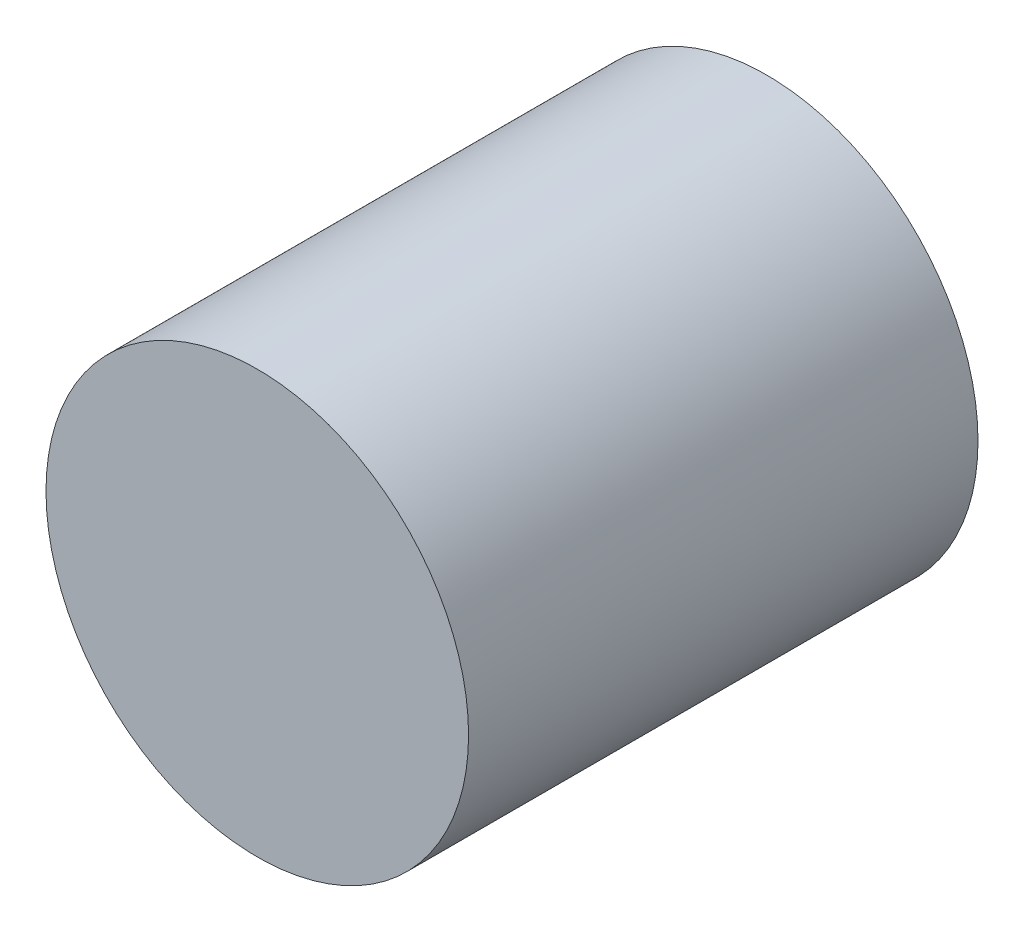
ISO-10303-21;
HEADER;
FILE_DESCRIPTION(('STEP AP214'),'2;1');
FILE_NAME('part.step','',(''),(''),'','','');
FILE_SCHEMA(('AUTOMOTIVE_DESIGN { 1 0 10303 214 1 1 1 1 }'));
ENDSEC;
DATA;
#1=APPLICATION_CONTEXT('core data for automotive mechanical design processes');
#2=APPLICATION_PROTOCOL_DEFINITION('international standard','automotive_design',2000,#1);
#3=PRODUCT_CONTEXT('',#1,'mechanical');
#4=PRODUCT('Part','Part','',(#3));
#5=PRODUCT_RELATED_PRODUCT_CATEGORY('part','',(#4));
#6=PRODUCT_DEFINITION_FORMATION('','',#4);
#7=PRODUCT_DEFINITION_CONTEXT('part definition',#1,'design');
#8=PRODUCT_DEFINITION('design','',#6,#7);
#9=PRODUCT_DEFINITION_SHAPE('','',#8);
#10=(LENGTH_UNIT() NAMED_UNIT(*) SI_UNIT(.MILLI.,.METRE.));
#11=(NAMED_UNIT(*) PLANE_ANGLE_UNIT() SI_UNIT($,.RADIAN.));
#12=(NAMED_UNIT(*) SI_UNIT($,.STERADIAN.) SOLID_ANGLE_UNIT());
#13=UNCERTAINTY_MEASURE_WITH_UNIT(LENGTH_MEASURE(1.E-05),#10,'distance_accuracy_value','');
#14=(GEOMETRIC_REPRESENTATION_CONTEXT(3) GLOBAL_UNCERTAINTY_ASSIGNED_CONTEXT((#13)) GLOBAL_UNIT_ASSIGNED_CONTEXT((#10,
#11,#12)) REPRESENTATION_CONTEXT('',''));
#15=CARTESIAN_POINT('',(0.,0.,0.));
#16=DIRECTION('',(0.,0.,1.));
#17=DIRECTION('',(1.,0.,0.));
#18=AXIS2_PLACEMENT_3D('',#15,#16,#17);
#19=CARTESIAN_POINT('',(2.286,0.,0.));
#20=DIRECTION('',(0.,0.,-1.));
#21=DIRECTION('',(-1.,0.,0.));
#22=AXIS2_PLACEMENT_3D('',#19,#20,#21);
#23=PLANE('',#22);
#24=CARTESIAN_POINT('',(0.,0.,0.));
#25=DIRECTION('',(0.,0.,-1.));
#26=DIRECTION('',(-1.,0.,0.));
#27=AXIS2_PLACEMENT_3D('',#24,#25,#26);
#28=CIRCLE('',#27,2.286);
#29=CARTESIAN_POINT('',(-2.286,0.,0.));
#30=VERTEX_POINT('',#29);
#31=EDGE_CURVE('E18',#30,#30,#28,.F.);
#32=ORIENTED_EDGE('',*,*,#31,.F.);
#33=EDGE_LOOP('',(#32));
#34=FACE_BOUND('',#33,.T.);
#35=ADVANCED_FACE('F15',(#34),#23,.T.);
#36=CARTESIAN_POINT('',(2.286,0.,5.5118));
#37=DIRECTION('',(0.,0.,-1.));
#38=DIRECTION('',(-1.,0.,0.));
#39=AXIS2_PLACEMENT_3D('',#36,#37,#38);
#40=PLANE('',#39);
#41=CARTESIAN_POINT('',(0.,0.,5.5118));
#42=DIRECTION('',(0.,0.,-1.));
#43=DIRECTION('',(-1.,0.,0.));
#44=AXIS2_PLACEMENT_3D('',#41,#42,#43);
#45=CIRCLE('',#44,2.286);
#46=CARTESIAN_POINT('',(-2.286,0.,5.5118));
#47=VERTEX_POINT('',#46);
#48=EDGE_CURVE('E10',#47,#47,#45,.T.);
#49=ORIENTED_EDGE('',*,*,#48,.F.);
#50=EDGE_LOOP('',(#49));
#51=FACE_BOUND('',#50,.T.);
#52=ADVANCED_FACE('F30',(#51),#40,.F.);
#53=CARTESIAN_POINT('',(0.,0.,0.));
#54=DIRECTION('',(0.,0.,-1.));
#55=DIRECTION('',(-1.,0.,0.));
#56=AXIS2_PLACEMENT_3D('',#53,#54,#55);
#57=CYLINDRICAL_SURFACE('',#56,2.286);
#58=ORIENTED_EDGE('',*,*,#48,.T.);
#59=EDGE_LOOP('',(#58));
#60=FACE_BOUND('',#59,.T.);
#61=ORIENTED_EDGE('',*,*,#31,.T.);
#62=EDGE_LOOP('',(#61));
#63=FACE_BOUND('',#62,.T.);
#64=ADVANCED_FACE('F27',(#60,#63),#57,.T.);
#65=CLOSED_SHELL('',(#35,#52,#64));
#66=MANIFOLD_SOLID_BREP('B1',#65);
#67=ADVANCED_BREP_SHAPE_REPRESENTATION('',(#18,#66),#14);
#68=SHAPE_DEFINITION_REPRESENTATION(#9,#67);
ENDSEC;
END-ISO-10303-21;
